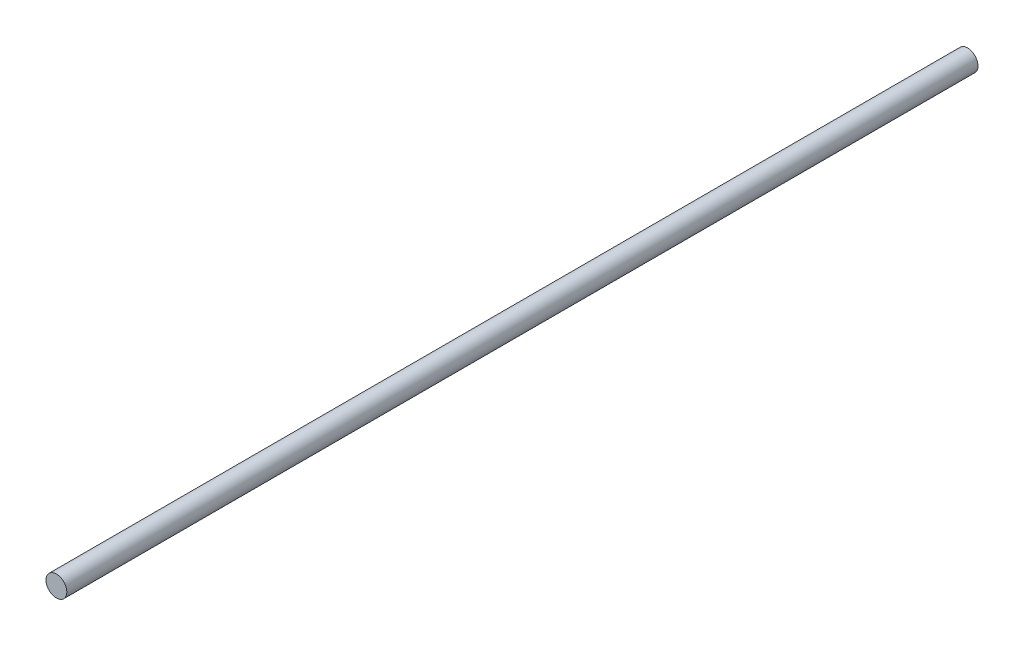
ISO-10303-21;
HEADER;
FILE_DESCRIPTION(('STEP AP214'),'2;1');
FILE_NAME('part.step','',(''),(''),'','','');
FILE_SCHEMA(('AUTOMOTIVE_DESIGN { 1 0 10303 214 1 1 1 1 }'));
ENDSEC;
DATA;
#1=APPLICATION_CONTEXT('core data for automotive mechanical design processes');
#2=APPLICATION_PROTOCOL_DEFINITION('international standard','automotive_design',2000,#1);
#3=PRODUCT_CONTEXT('',#1,'mechanical');
#4=PRODUCT('Part','Part','',(#3));
#5=PRODUCT_RELATED_PRODUCT_CATEGORY('part','',(#4));
#6=PRODUCT_DEFINITION_FORMATION('','',#4);
#7=PRODUCT_DEFINITION_CONTEXT('part definition',#1,'design');
#8=PRODUCT_DEFINITION('design','',#6,#7);
#9=PRODUCT_DEFINITION_SHAPE('','',#8);
#10=(LENGTH_UNIT() NAMED_UNIT(*) SI_UNIT(.MILLI.,.METRE.));
#11=(NAMED_UNIT(*) PLANE_ANGLE_UNIT() SI_UNIT($,.RADIAN.));
#12=(NAMED_UNIT(*) SI_UNIT($,.STERADIAN.) SOLID_ANGLE_UNIT());
#13=UNCERTAINTY_MEASURE_WITH_UNIT(LENGTH_MEASURE(1.E-05),#10,'distance_accuracy_value','');
#14=(GEOMETRIC_REPRESENTATION_CONTEXT(3) GLOBAL_UNCERTAINTY_ASSIGNED_CONTEXT((#13)) GLOBAL_UNIT_ASSIGNED_CONTEXT((#10,
#11,#12)) REPRESENTATION_CONTEXT('',''));
#15=CARTESIAN_POINT('',(0.,0.,0.));
#16=DIRECTION('',(0.,0.,1.));
#17=DIRECTION('',(1.,0.,0.));
#18=AXIS2_PLACEMENT_3D('',#15,#16,#17);
#19=CARTESIAN_POINT('',(29.9327937088876,-2.10555246905386,-200.));
#20=DIRECTION('',(0.,0.,1.));
#21=DIRECTION('',(1.,0.,0.));
#22=AXIS2_PLACEMENT_3D('',#19,#20,#21);
#23=CYLINDRICAL_SURFACE('',#22,4.00000000000001);
#24=CARTESIAN_POINT('',(29.9327937088876,-2.10555246905386,-200.));
#25=DIRECTION('',(0.,0.,1.));
#26=DIRECTION('',(1.,0.,0.));
#27=AXIS2_PLACEMENT_3D('',#24,#25,#26);
#28=CIRCLE('',#27,4.00000000000001);
#29=CARTESIAN_POINT('',(33.9327937088876,-2.10555246905386,-200.));
#30=VERTEX_POINT('',#29);
#31=EDGE_CURVE('E10',#30,#30,#28,.T.);
#32=ORIENTED_EDGE('',*,*,#31,.T.);
#33=EDGE_LOOP('',(#32));
#34=FACE_BOUND('',#33,.T.);
#35=CARTESIAN_POINT('',(29.9327937088876,-2.10555246905386,150.));
#36=DIRECTION('',(0.,0.,1.));
#37=DIRECTION('',(1.,0.,0.));
#38=AXIS2_PLACEMENT_3D('',#35,#36,#37);
#39=CIRCLE('',#38,4.00000000000001);
#40=CARTESIAN_POINT('',(33.9327937088876,-2.10555246905386,150.));
#41=VERTEX_POINT('',#40);
#42=EDGE_CURVE('E34',#41,#41,#39,.T.);
#43=ORIENTED_EDGE('',*,*,#42,.F.);
#44=EDGE_LOOP('',(#43));
#45=FACE_BOUND('',#44,.T.);
#46=ADVANCED_FACE('F28',(#34,#45),#23,.T.);
#47=CARTESIAN_POINT('',(29.9327937088876,-2.10555246905386,-200.));
#48=DIRECTION('',(0.,0.,1.));
#49=DIRECTION('',(1.,0.,0.));
#50=AXIS2_PLACEMENT_3D('',#47,#48,#49);
#51=PLANE('',#50);
#52=ORIENTED_EDGE('',*,*,#31,.F.);
#53=EDGE_LOOP('',(#52));
#54=FACE_BOUND('',#53,.T.);
#55=ADVANCED_FACE('F43',(#54),#51,.F.);
#56=CARTESIAN_POINT('',(29.9327937088876,-2.10555246905386,150.));
#57=DIRECTION('',(0.,0.,1.));
#58=DIRECTION('',(1.,0.,0.));
#59=AXIS2_PLACEMENT_3D('',#56,#57,#58);
#60=PLANE('',#59);
#61=ORIENTED_EDGE('',*,*,#42,.T.);
#62=EDGE_LOOP('',(#61));
#63=FACE_BOUND('',#62,.T.);
#64=ADVANCED_FACE('F40',(#63),#60,.T.);
#65=CLOSED_SHELL('',(#46,#55,#64));
#66=MANIFOLD_SOLID_BREP('B2',#65);
#67=ADVANCED_BREP_SHAPE_REPRESENTATION('',(#18,#66),#14);
#68=SHAPE_DEFINITION_REPRESENTATION(#9,#67);
ENDSEC;
END-ISO-10303-21;
